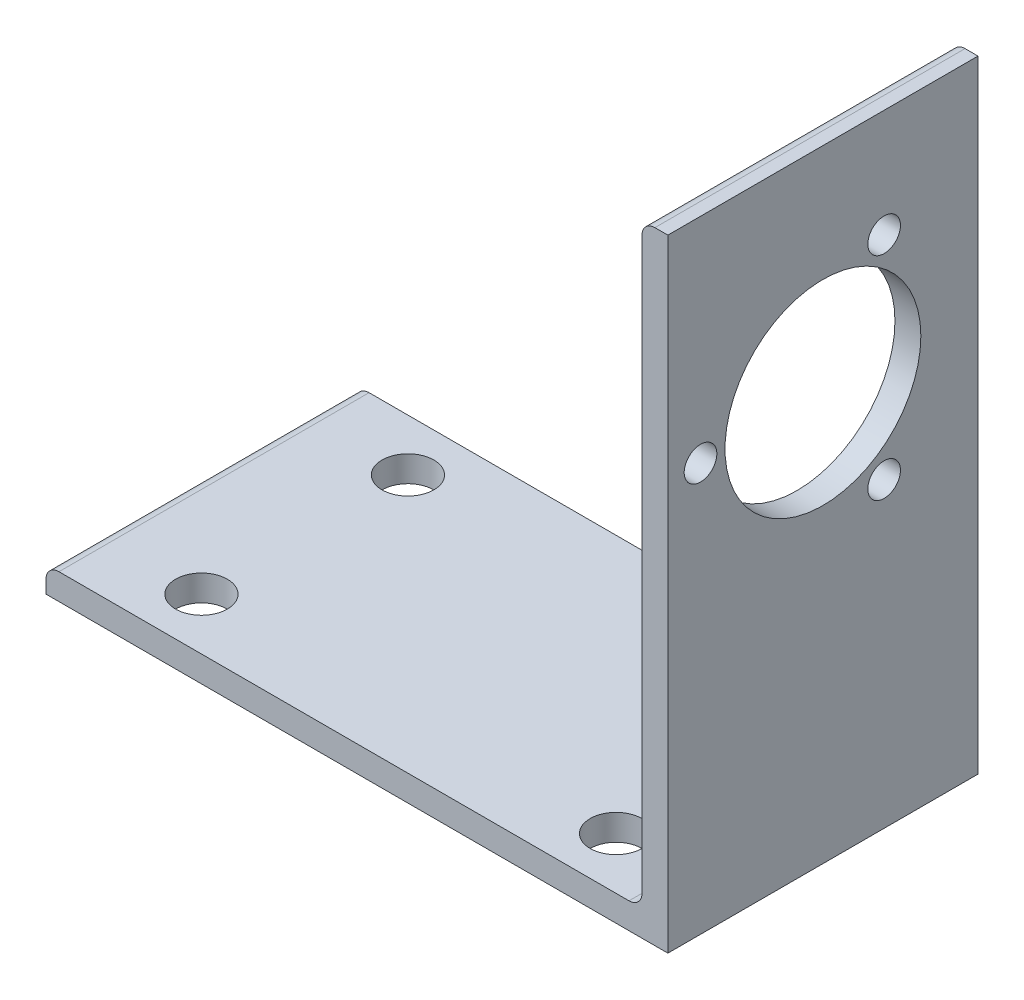
ISO-10303-21;
HEADER;
FILE_DESCRIPTION(('STEP AP214'),'2;1');
FILE_NAME('part.step','',(''),(''),'','','');
FILE_SCHEMA(('AUTOMOTIVE_DESIGN { 1 0 10303 214 1 1 1 1 }'));
ENDSEC;
DATA;
#1=APPLICATION_CONTEXT('core data for automotive mechanical design processes');
#2=APPLICATION_PROTOCOL_DEFINITION('international standard','automotive_design',2000,#1);
#3=PRODUCT_CONTEXT('',#1,'mechanical');
#4=PRODUCT('Part','Part','',(#3));
#5=PRODUCT_RELATED_PRODUCT_CATEGORY('part','',(#4));
#6=PRODUCT_DEFINITION_FORMATION('','',#4);
#7=PRODUCT_DEFINITION_CONTEXT('part definition',#1,'design');
#8=PRODUCT_DEFINITION('design','',#6,#7);
#9=PRODUCT_DEFINITION_SHAPE('','',#8);
#10=(LENGTH_UNIT() NAMED_UNIT(*) SI_UNIT(.MILLI.,.METRE.));
#11=(NAMED_UNIT(*) PLANE_ANGLE_UNIT() SI_UNIT($,.RADIAN.));
#12=(NAMED_UNIT(*) SI_UNIT($,.STERADIAN.) SOLID_ANGLE_UNIT());
#13=UNCERTAINTY_MEASURE_WITH_UNIT(LENGTH_MEASURE(1.E-05),#10,'distance_accuracy_value','');
#14=(GEOMETRIC_REPRESENTATION_CONTEXT(3) GLOBAL_UNCERTAINTY_ASSIGNED_CONTEXT((#13)) GLOBAL_UNIT_ASSIGNED_CONTEXT((#10,
#11,#12)) REPRESENTATION_CONTEXT('',''));
#15=CARTESIAN_POINT('',(0.,0.,0.));
#16=DIRECTION('',(0.,0.,1.));
#17=DIRECTION('',(1.,0.,0.));
#18=AXIS2_PLACEMENT_3D('',#15,#16,#17);
#19=CARTESIAN_POINT('',(17.4625,37.30625,-18.9999999999999));
#20=DIRECTION('',(-1.,0.,0.));
#21=DIRECTION('',(0.,-1.,0.));
#22=AXIS2_PLACEMENT_3D('',#19,#20,#21);
#23=PLANE('',#22);
#24=CARTESIAN_POINT('',(17.4625,18.5048094715972,-13.25));
#25=DIRECTION('',(-1.,0.,0.));
#26=DIRECTION('',(0.,-1.,0.));
#27=AXIS2_PLACEMENT_3D('',#24,#25,#26);
#28=CIRCLE('',#27,1.00000000000001);
#29=CARTESIAN_POINT('',(17.4625,17.5048094715972,-13.25));
#30=VERTEX_POINT('',#29);
#31=EDGE_CURVE('E258',#30,#30,#28,.T.);
#32=ORIENTED_EDGE('',*,*,#31,.F.);
#33=EDGE_LOOP('',(#32));
#34=FACE_BOUND('',#33,.T.);
#35=DIRECTION('',(0.,-1.,0.));
#36=VECTOR('',#35,1.);
#37=CARTESIAN_POINT('',(17.4625,37.30625,0.));
#38=LINE('',#37,#36);
#39=CARTESIAN_POINT('',(17.4625,37.30625,0.));
#40=VERTEX_POINT('',#39);
#41=CARTESIAN_POINT('',(17.4625,2.38124999999999,0.));
#42=VERTEX_POINT('',#41);
#43=EDGE_CURVE('E168',#40,#42,#38,.T.);
#44=ORIENTED_EDGE('',*,*,#43,.F.);
#45=DIRECTION('',(0.,0.,1.));
#46=VECTOR('',#45,1.);
#47=CARTESIAN_POINT('',(17.4625,37.30625,-18.9999999999999));
#48=LINE('',#47,#46);
#49=CARTESIAN_POINT('',(17.4625,37.30625,-18.9999999999999));
#50=VERTEX_POINT('',#49);
#51=EDGE_CURVE('E180',#50,#40,#48,.T.);
#52=ORIENTED_EDGE('',*,*,#51,.F.);
#53=DIRECTION('',(0.,-1.,0.));
#54=VECTOR('',#53,1.);
#55=CARTESIAN_POINT('',(17.4625,37.30625,-18.9999999999999));
#56=LINE('',#55,#54);
#57=CARTESIAN_POINT('',(17.4625,2.38124999999999,-18.9999999999999));
#58=VERTEX_POINT('',#57);
#59=EDGE_CURVE('E145',#50,#58,#56,.T.);
#60=ORIENTED_EDGE('',*,*,#59,.T.);
#61=DIRECTION('',(0.,0.,1.));
#62=VECTOR('',#61,1.);
#63=CARTESIAN_POINT('',(17.4625,2.38124999999999,-18.9999999999999));
#64=LINE('',#63,#62);
#65=EDGE_CURVE('E134',#58,#42,#64,.T.);
#66=ORIENTED_EDGE('',*,*,#65,.T.);
#67=EDGE_LOOP('',(#44,#52,#60,#66));
#68=FACE_BOUND('',#67,.T.);
#69=CARTESIAN_POINT('',(17.4625,24.9999999999972,-9.49999999999995));
#70=DIRECTION('',(-1.,0.,0.));
#71=DIRECTION('',(0.,-1.,0.));
#72=AXIS2_PLACEMENT_3D('',#69,#70,#71);
#73=CIRCLE('',#72,5.99948);
#74=CARTESIAN_POINT('',(17.4625,19.0005199999972,-9.49999999999995));
#75=VERTEX_POINT('',#74);
#76=EDGE_CURVE('E261',#75,#75,#73,.F.);
#77=ORIENTED_EDGE('',*,*,#76,.T.);
#78=EDGE_LOOP('',(#77));
#79=FACE_BOUND('',#78,.T.);
#80=CARTESIAN_POINT('',(17.4625,31.4951905283972,-13.25));
#81=DIRECTION('',(-1.,0.,0.));
#82=DIRECTION('',(0.,-1.,0.));
#83=AXIS2_PLACEMENT_3D('',#80,#81,#82);
#84=CIRCLE('',#83,1.00000000000001);
#85=CARTESIAN_POINT('',(17.4625,30.4951905283972,-13.25));
#86=VERTEX_POINT('',#85);
#87=EDGE_CURVE('E257',#86,#86,#84,.T.);
#88=ORIENTED_EDGE('',*,*,#87,.F.);
#89=EDGE_LOOP('',(#88));
#90=FACE_BOUND('',#89,.T.);
#91=CARTESIAN_POINT('',(17.4625,24.9999999999972,-2.));
#92=DIRECTION('',(-1.,0.,0.));
#93=DIRECTION('',(0.,-1.,0.));
#94=AXIS2_PLACEMENT_3D('',#91,#92,#93);
#95=CIRCLE('',#94,1.);
#96=CARTESIAN_POINT('',(17.4625,23.9999999999972,-2.));
#97=VERTEX_POINT('',#96);
#98=EDGE_CURVE('E246',#97,#97,#95,.T.);
#99=ORIENTED_EDGE('',*,*,#98,.F.);
#100=EDGE_LOOP('',(#99));
#101=FACE_BOUND('',#100,.T.);
#102=ADVANCED_FACE('F48',(#34,#68,#79,#90,#101),#23,.T.);
#103=CARTESIAN_POINT('',(19.05,0.,-18.9999999999999));
#104=DIRECTION('',(1.,0.,0.));
#105=DIRECTION('',(0.,1.,0.));
#106=AXIS2_PLACEMENT_3D('',#103,#104,#105);
#107=PLANE('',#106);
#108=CARTESIAN_POINT('',(19.05,18.5048094715972,-13.25));
#109=DIRECTION('',(1.,0.,0.));
#110=DIRECTION('',(0.,0.,-1.));
#111=AXIS2_PLACEMENT_3D('',#108,#109,#110);
#112=CIRCLE('',#111,1.00000000000001);
#113=CARTESIAN_POINT('',(19.05,18.5048094715972,-14.25));
#114=VERTEX_POINT('',#113);
#115=EDGE_CURVE('E262',#114,#114,#112,.F.);
#116=ORIENTED_EDGE('',*,*,#115,.T.);
#117=EDGE_LOOP('',(#116));
#118=FACE_BOUND('',#117,.T.);
#119=DIRECTION('',(0.,1.,0.));
#120=VECTOR('',#119,1.);
#121=CARTESIAN_POINT('',(19.05,0.,0.));
#122=LINE('',#121,#120);
#123=CARTESIAN_POINT('',(19.05,0.,0.));
#124=VERTEX_POINT('',#123);
#125=CARTESIAN_POINT('',(19.05,38.1,0.));
#126=VERTEX_POINT('',#125);
#127=EDGE_CURVE('E159',#124,#126,#122,.T.);
#128=ORIENTED_EDGE('',*,*,#127,.F.);
#129=DIRECTION('',(0.,0.,1.));
#130=VECTOR('',#129,1.);
#131=CARTESIAN_POINT('',(19.05,0.,-18.9999999999999));
#132=LINE('',#131,#130);
#133=CARTESIAN_POINT('',(19.05,0.,-18.9999999999999));
#134=VERTEX_POINT('',#133);
#135=EDGE_CURVE('E185',#134,#124,#132,.T.);
#136=ORIENTED_EDGE('',*,*,#135,.F.);
#137=DIRECTION('',(0.,1.,0.));
#138=VECTOR('',#137,1.);
#139=CARTESIAN_POINT('',(19.05,0.,-18.9999999999999));
#140=LINE('',#139,#138);
#141=CARTESIAN_POINT('',(19.05,38.1,-18.9999999999999));
#142=VERTEX_POINT('',#141);
#143=EDGE_CURVE('E276',#134,#142,#140,.T.);
#144=ORIENTED_EDGE('',*,*,#143,.T.);
#145=DIRECTION('',(0.,0.,1.));
#146=VECTOR('',#145,1.);
#147=CARTESIAN_POINT('',(19.05,38.1,-18.9999999999999));
#148=LINE('',#147,#146);
#149=EDGE_CURVE('E184',#142,#126,#148,.T.);
#150=ORIENTED_EDGE('',*,*,#149,.T.);
#151=EDGE_LOOP('',(#128,#136,#144,#150));
#152=FACE_BOUND('',#151,.T.);
#153=CARTESIAN_POINT('',(19.05,24.9999999999972,-9.49999999999995));
#154=DIRECTION('',(1.,0.,0.));
#155=DIRECTION('',(0.,0.,-1.));
#156=AXIS2_PLACEMENT_3D('',#153,#154,#155);
#157=CIRCLE('',#156,5.99948);
#158=CARTESIAN_POINT('',(19.05,24.9999999999972,-15.49948));
#159=VERTEX_POINT('',#158);
#160=EDGE_CURVE('E156',#159,#159,#157,.T.);
#161=ORIENTED_EDGE('',*,*,#160,.F.);
#162=EDGE_LOOP('',(#161));
#163=FACE_BOUND('',#162,.T.);
#164=CARTESIAN_POINT('',(19.05,31.4951905283972,-13.25));
#165=DIRECTION('',(1.,0.,0.));
#166=DIRECTION('',(0.,0.,-1.));
#167=AXIS2_PLACEMENT_3D('',#164,#165,#166);
#168=CIRCLE('',#167,1.00000000000001);
#169=CARTESIAN_POINT('',(19.05,31.4951905283972,-14.25));
#170=VERTEX_POINT('',#169);
#171=EDGE_CURVE('E254',#170,#170,#168,.F.);
#172=ORIENTED_EDGE('',*,*,#171,.T.);
#173=EDGE_LOOP('',(#172));
#174=FACE_BOUND('',#173,.T.);
#175=CARTESIAN_POINT('',(19.05,24.9999999999972,-2.));
#176=DIRECTION('',(1.,0.,0.));
#177=DIRECTION('',(0.,0.,-1.));
#178=AXIS2_PLACEMENT_3D('',#175,#176,#177);
#179=CIRCLE('',#178,1.);
#180=CARTESIAN_POINT('',(19.05,24.9999999999972,-3.));
#181=VERTEX_POINT('',#180);
#182=EDGE_CURVE('E242',#181,#181,#179,.F.);
#183=ORIENTED_EDGE('',*,*,#182,.T.);
#184=EDGE_LOOP('',(#183));
#185=FACE_BOUND('',#184,.T.);
#186=ADVANCED_FACE('F199',(#118,#152,#163,#174,#185),#107,.T.);
#187=CARTESIAN_POINT('',(-19.05,0.793749999999996,-18.9999999999999));
#188=DIRECTION('',(-1.,0.,0.));
#189=DIRECTION('',(0.,0.,1.));
#190=AXIS2_PLACEMENT_3D('',#187,#188,#189);
#191=PLANE('',#190);
#192=DIRECTION('',(0.,-1.,0.));
#193=VECTOR('',#192,1.);
#194=CARTESIAN_POINT('',(-19.05,0.793749999999996,0.));
#195=LINE('',#194,#193);
#196=CARTESIAN_POINT('',(-19.05,0.793749999999996,0.));
#197=VERTEX_POINT('',#196);
#198=CARTESIAN_POINT('',(-19.05,0.,0.));
#199=VERTEX_POINT('',#198);
#200=EDGE_CURVE('E152',#197,#199,#195,.T.);
#201=ORIENTED_EDGE('',*,*,#200,.F.);
#202=DIRECTION('',(0.,0.,1.));
#203=VECTOR('',#202,1.);
#204=CARTESIAN_POINT('',(-19.05,0.793749999999996,-18.9999999999999));
#205=LINE('',#204,#203);
#206=CARTESIAN_POINT('',(-19.05,0.793749999999996,-18.9999999999999));
#207=VERTEX_POINT('',#206);
#208=EDGE_CURVE('E12',#207,#197,#205,.T.);
#209=ORIENTED_EDGE('',*,*,#208,.F.);
#210=DIRECTION('',(0.,-1.,0.));
#211=VECTOR('',#210,1.);
#212=CARTESIAN_POINT('',(-19.05,0.793749999999996,-18.9999999999999));
#213=LINE('',#212,#211);
#214=CARTESIAN_POINT('',(-19.05,0.,-18.9999999999999));
#215=VERTEX_POINT('',#214);
#216=EDGE_CURVE('E176',#207,#215,#213,.T.);
#217=ORIENTED_EDGE('',*,*,#216,.T.);
#218=DIRECTION('',(0.,0.,1.));
#219=VECTOR('',#218,1.);
#220=CARTESIAN_POINT('',(-19.05,0.,-18.9999999999999));
#221=LINE('',#220,#219);
#222=EDGE_CURVE('E52',#215,#199,#221,.T.);
#223=ORIENTED_EDGE('',*,*,#222,.T.);
#224=EDGE_LOOP('',(#201,#209,#217,#223));
#225=FACE_BOUND('',#224,.T.);
#226=ADVANCED_FACE('F50',(#225),#191,.T.);
#227=CARTESIAN_POINT('',(-18.25625,0.793749999999996,-18.9999999999999));
#228=DIRECTION('',(0.,0.,1.));
#229=DIRECTION('',(1.,0.,0.));
#230=AXIS2_PLACEMENT_3D('',#227,#228,#229);
#231=CYLINDRICAL_SURFACE('',#230,0.793749999999996);
#232=CARTESIAN_POINT('',(-18.25625,0.793749999999996,0.));
#233=DIRECTION('',(0.,0.,1.));
#234=DIRECTION('',(-1.,0.,0.));
#235=AXIS2_PLACEMENT_3D('',#232,#233,#234);
#236=CIRCLE('',#235,0.793749999999996);
#237=CARTESIAN_POINT('',(-18.25625,1.58749999999999,0.));
#238=VERTEX_POINT('',#237);
#239=EDGE_CURVE('E174',#238,#197,#236,.T.);
#240=ORIENTED_EDGE('',*,*,#239,.F.);
#241=DIRECTION('',(0.,0.,1.));
#242=VECTOR('',#241,1.);
#243=CARTESIAN_POINT('',(-18.25625,1.58749999999999,-18.9999999999999));
#244=LINE('',#243,#242);
#245=CARTESIAN_POINT('',(-18.25625,1.58749999999999,-18.9999999999999));
#246=VERTEX_POINT('',#245);
#247=EDGE_CURVE('E58',#246,#238,#244,.T.);
#248=ORIENTED_EDGE('',*,*,#247,.F.);
#249=CARTESIAN_POINT('',(-18.25625,0.793749999999996,-18.9999999999999));
#250=DIRECTION('',(0.,0.,1.));
#251=DIRECTION('',(-1.,0.,0.));
#252=AXIS2_PLACEMENT_3D('',#249,#250,#251);
#253=CIRCLE('',#252,0.793749999999996);
#254=EDGE_CURVE('E142',#246,#207,#253,.T.);
#255=ORIENTED_EDGE('',*,*,#254,.T.);
#256=ORIENTED_EDGE('',*,*,#208,.T.);
#257=EDGE_LOOP('',(#240,#248,#255,#256));
#258=FACE_BOUND('',#257,.T.);
#259=ADVANCED_FACE('F190',(#258),#231,.T.);
#260=CARTESIAN_POINT('',(16.66875,1.5875,-18.9999999999999));
#261=DIRECTION('',(0.,1.,0.));
#262=DIRECTION('',(-1.,0.,0.));
#263=AXIS2_PLACEMENT_3D('',#260,#261,#262);
#264=PLANE('',#263);
#265=CARTESIAN_POINT('',(-12.7,1.5875,-3.175));
#266=DIRECTION('',(0.,1.,0.));
#267=DIRECTION('',(-1.,0.,0.));
#268=AXIS2_PLACEMENT_3D('',#265,#266,#267);
#269=CIRCLE('',#268,1.5875);
#270=CARTESIAN_POINT('',(-14.2875,1.5875,-3.175));
#271=VERTEX_POINT('',#270);
#272=EDGE_CURVE('E251',#271,#271,#269,.F.);
#273=ORIENTED_EDGE('',*,*,#272,.T.);
#274=EDGE_LOOP('',(#273));
#275=FACE_BOUND('',#274,.T.);
#276=CARTESIAN_POINT('',(12.7,1.5875,-3.175));
#277=DIRECTION('',(0.,1.,0.));
#278=DIRECTION('',(-1.,0.,0.));
#279=AXIS2_PLACEMENT_3D('',#276,#277,#278);
#280=CIRCLE('',#279,1.5875);
#281=CARTESIAN_POINT('',(11.1125,1.5875,-3.175));
#282=VERTEX_POINT('',#281);
#283=EDGE_CURVE('E403',#282,#282,#280,.F.);
#284=ORIENTED_EDGE('',*,*,#283,.T.);
#285=EDGE_LOOP('',(#284));
#286=FACE_BOUND('',#285,.T.);
#287=CARTESIAN_POINT('',(12.7,1.5875,-15.8249999999999));
#288=DIRECTION('',(0.,1.,0.));
#289=DIRECTION('',(-1.,0.,0.));
#290=AXIS2_PLACEMENT_3D('',#287,#288,#289);
#291=CIRCLE('',#290,1.5875);
#292=CARTESIAN_POINT('',(11.1125,1.5875,-15.8249999999999));
#293=VERTEX_POINT('',#292);
#294=EDGE_CURVE('E408',#293,#293,#291,.F.);
#295=ORIENTED_EDGE('',*,*,#294,.T.);
#296=EDGE_LOOP('',(#295));
#297=FACE_BOUND('',#296,.T.);
#298=CARTESIAN_POINT('',(-12.7,1.5875,-15.8249999999999));
#299=DIRECTION('',(0.,1.,0.));
#300=DIRECTION('',(-1.,0.,0.));
#301=AXIS2_PLACEMENT_3D('',#298,#299,#300);
#302=CIRCLE('',#301,1.5875);
#303=CARTESIAN_POINT('',(-14.2875,1.5875,-15.8249999999999));
#304=VERTEX_POINT('',#303);
#305=EDGE_CURVE('E243',#304,#304,#302,.F.);
#306=ORIENTED_EDGE('',*,*,#305,.T.);
#307=EDGE_LOOP('',(#306));
#308=FACE_BOUND('',#307,.T.);
#309=DIRECTION('',(-1.,0.,0.));
#310=VECTOR('',#309,1.);
#311=CARTESIAN_POINT('',(16.66875,1.5875,0.));
#312=LINE('',#311,#310);
#313=CARTESIAN_POINT('',(16.66875,1.5875,0.));
#314=VERTEX_POINT('',#313);
#315=EDGE_CURVE('E129',#314,#238,#312,.T.);
#316=ORIENTED_EDGE('',*,*,#315,.F.);
#317=DIRECTION('',(0.,0.,1.));
#318=VECTOR('',#317,1.);
#319=CARTESIAN_POINT('',(16.66875,1.5875,-18.9999999999999));
#320=LINE('',#319,#318);
#321=CARTESIAN_POINT('',(16.66875,1.5875,-18.9999999999999));
#322=VERTEX_POINT('',#321);
#323=EDGE_CURVE('E124',#322,#314,#320,.T.);
#324=ORIENTED_EDGE('',*,*,#323,.F.);
#325=DIRECTION('',(-1.,0.,0.));
#326=VECTOR('',#325,1.);
#327=CARTESIAN_POINT('',(16.66875,1.5875,-18.9999999999999));
#328=LINE('',#327,#326);
#329=EDGE_CURVE('E127',#322,#246,#328,.T.);
#330=ORIENTED_EDGE('',*,*,#329,.T.);
#331=ORIENTED_EDGE('',*,*,#247,.T.);
#332=EDGE_LOOP('',(#316,#324,#330,#331));
#333=FACE_BOUND('',#332,.T.);
#334=ADVANCED_FACE('F126',(#275,#286,#297,#308,#333),#264,.T.);
#335=CARTESIAN_POINT('',(16.66875,2.38124999999999,-18.9999999999999));
#336=DIRECTION('',(0.,0.,1.));
#337=DIRECTION('',(1.,0.,0.));
#338=AXIS2_PLACEMENT_3D('',#335,#336,#337);
#339=CYLINDRICAL_SURFACE('',#338,0.793749999999995);
#340=CARTESIAN_POINT('',(16.66875,2.38124999999999,0.));
#341=DIRECTION('',(0.,0.,-1.));
#342=DIRECTION('',(-1.,0.,0.));
#343=AXIS2_PLACEMENT_3D('',#340,#341,#342);
#344=CIRCLE('',#343,0.793749999999995);
#345=EDGE_CURVE('E171',#42,#314,#344,.T.);
#346=ORIENTED_EDGE('',*,*,#345,.F.);
#347=ORIENTED_EDGE('',*,*,#65,.F.);
#348=CARTESIAN_POINT('',(16.66875,2.38124999999999,-18.9999999999999));
#349=DIRECTION('',(0.,0.,-1.));
#350=DIRECTION('',(-1.,0.,0.));
#351=AXIS2_PLACEMENT_3D('',#348,#349,#350);
#352=CIRCLE('',#351,0.793749999999995);
#353=EDGE_CURVE('E140',#58,#322,#352,.T.);
#354=ORIENTED_EDGE('',*,*,#353,.T.);
#355=ORIENTED_EDGE('',*,*,#323,.T.);
#356=EDGE_LOOP('',(#346,#347,#354,#355));
#357=FACE_BOUND('',#356,.T.);
#358=ADVANCED_FACE('F144',(#357),#339,.F.);
#359=CARTESIAN_POINT('',(18.25625,37.30625,-18.9999999999999));
#360=DIRECTION('',(0.,0.,1.));
#361=DIRECTION('',(1.,0.,0.));
#362=AXIS2_PLACEMENT_3D('',#359,#360,#361);
#363=CYLINDRICAL_SURFACE('',#362,0.793749999999996);
#364=CARTESIAN_POINT('',(18.25625,37.30625,0.));
#365=DIRECTION('',(0.,0.,1.));
#366=DIRECTION('',(-1.,0.,0.));
#367=AXIS2_PLACEMENT_3D('',#364,#365,#366);
#368=CIRCLE('',#367,0.793749999999996);
#369=CARTESIAN_POINT('',(18.25625,38.1,0.));
#370=VERTEX_POINT('',#369);
#371=EDGE_CURVE('E165',#370,#40,#368,.T.);
#372=ORIENTED_EDGE('',*,*,#371,.F.);
#373=DIRECTION('',(0.,0.,1.));
#374=VECTOR('',#373,1.);
#375=CARTESIAN_POINT('',(18.25625,38.1,-18.9999999999999));
#376=LINE('',#375,#374);
#377=CARTESIAN_POINT('',(18.25625,38.1,-18.9999999999999));
#378=VERTEX_POINT('',#377);
#379=EDGE_CURVE('E182',#378,#370,#376,.T.);
#380=ORIENTED_EDGE('',*,*,#379,.F.);
#381=CARTESIAN_POINT('',(18.25625,37.30625,-18.9999999999999));
#382=DIRECTION('',(0.,0.,1.));
#383=DIRECTION('',(-1.,0.,0.));
#384=AXIS2_PLACEMENT_3D('',#381,#382,#383);
#385=CIRCLE('',#384,0.793749999999996);
#386=EDGE_CURVE('E147',#378,#50,#385,.T.);
#387=ORIENTED_EDGE('',*,*,#386,.T.);
#388=ORIENTED_EDGE('',*,*,#51,.T.);
#389=EDGE_LOOP('',(#372,#380,#387,#388));
#390=FACE_BOUND('',#389,.T.);
#391=ADVANCED_FACE('F213',(#390),#363,.T.);
#392=CARTESIAN_POINT('',(18.25625,38.1,-18.9999999999999));
#393=DIRECTION('',(0.,1.,0.));
#394=DIRECTION('',(0.,0.,1.));
#395=AXIS2_PLACEMENT_3D('',#392,#393,#394);
#396=PLANE('',#395);
#397=DIRECTION('',(-1.,0.,0.));
#398=VECTOR('',#397,1.);
#399=CARTESIAN_POINT('',(18.25625,38.1,0.));
#400=LINE('',#399,#398);
#401=EDGE_CURVE('E162',#126,#370,#400,.T.);
#402=ORIENTED_EDGE('',*,*,#401,.F.);
#403=ORIENTED_EDGE('',*,*,#149,.F.);
#404=DIRECTION('',(-1.,0.,0.));
#405=VECTOR('',#404,1.);
#406=CARTESIAN_POINT('',(18.25625,38.1,-18.9999999999999));
#407=LINE('',#406,#405);
#408=EDGE_CURVE('E279',#142,#378,#407,.T.);
#409=ORIENTED_EDGE('',*,*,#408,.T.);
#410=ORIENTED_EDGE('',*,*,#379,.T.);
#411=EDGE_LOOP('',(#402,#403,#409,#410));
#412=FACE_BOUND('',#411,.T.);
#413=ADVANCED_FACE('F216',(#412),#396,.T.);
#414=CARTESIAN_POINT('',(-19.05,0.,-18.9999999999999));
#415=DIRECTION('',(0.,-1.,0.));
#416=DIRECTION('',(0.,0.,-1.));
#417=AXIS2_PLACEMENT_3D('',#414,#415,#416);
#418=PLANE('',#417);
#419=CARTESIAN_POINT('',(-12.7,0.,-3.175));
#420=DIRECTION('',(0.,-1.,0.));
#421=DIRECTION('',(0.,0.,-1.));
#422=AXIS2_PLACEMENT_3D('',#419,#420,#421);
#423=CIRCLE('',#422,1.5875);
#424=CARTESIAN_POINT('',(-12.7,0.,-4.7625));
#425=VERTEX_POINT('',#424);
#426=EDGE_CURVE('E229',#425,#425,#423,.T.);
#427=ORIENTED_EDGE('',*,*,#426,.F.);
#428=EDGE_LOOP('',(#427));
#429=FACE_BOUND('',#428,.T.);
#430=CARTESIAN_POINT('',(12.7,0.,-3.175));
#431=DIRECTION('',(0.,-1.,0.));
#432=DIRECTION('',(0.,0.,-1.));
#433=AXIS2_PLACEMENT_3D('',#430,#431,#432);
#434=CIRCLE('',#433,1.5875);
#435=CARTESIAN_POINT('',(12.7,0.,-4.76250000000001));
#436=VERTEX_POINT('',#435);
#437=EDGE_CURVE('E233',#436,#436,#434,.T.);
#438=ORIENTED_EDGE('',*,*,#437,.F.);
#439=EDGE_LOOP('',(#438));
#440=FACE_BOUND('',#439,.T.);
#441=CARTESIAN_POINT('',(12.7,0.,-15.8249999999999));
#442=DIRECTION('',(0.,-1.,0.));
#443=DIRECTION('',(0.,0.,-1.));
#444=AXIS2_PLACEMENT_3D('',#441,#442,#443);
#445=CIRCLE('',#444,1.5875);
#446=CARTESIAN_POINT('',(12.7,0.,-17.4124999999999));
#447=VERTEX_POINT('',#446);
#448=EDGE_CURVE('E237',#447,#447,#445,.T.);
#449=ORIENTED_EDGE('',*,*,#448,.F.);
#450=EDGE_LOOP('',(#449));
#451=FACE_BOUND('',#450,.T.);
#452=CARTESIAN_POINT('',(-12.7,0.,-15.8249999999999));
#453=DIRECTION('',(0.,-1.,0.));
#454=DIRECTION('',(0.,0.,-1.));
#455=AXIS2_PLACEMENT_3D('',#452,#453,#454);
#456=CIRCLE('',#455,1.5875);
#457=CARTESIAN_POINT('',(-12.7,0.,-17.4124999999999));
#458=VERTEX_POINT('',#457);
#459=EDGE_CURVE('E240',#458,#458,#456,.T.);
#460=ORIENTED_EDGE('',*,*,#459,.F.);
#461=EDGE_LOOP('',(#460));
#462=FACE_BOUND('',#461,.T.);
#463=DIRECTION('',(1.,0.,0.));
#464=VECTOR('',#463,1.);
#465=CARTESIAN_POINT('',(-19.05,0.,0.));
#466=LINE('',#465,#464);
#467=EDGE_CURVE('E155',#199,#124,#466,.T.);
#468=ORIENTED_EDGE('',*,*,#467,.F.);
#469=ORIENTED_EDGE('',*,*,#222,.F.);
#470=DIRECTION('',(1.,0.,0.));
#471=VECTOR('',#470,1.);
#472=CARTESIAN_POINT('',(-19.05,0.,-18.9999999999999));
#473=LINE('',#472,#471);
#474=EDGE_CURVE('E274',#215,#134,#473,.T.);
#475=ORIENTED_EDGE('',*,*,#474,.T.);
#476=ORIENTED_EDGE('',*,*,#135,.T.);
#477=EDGE_LOOP('',(#468,#469,#475,#476));
#478=FACE_BOUND('',#477,.T.);
#479=ADVANCED_FACE('F187',(#429,#440,#451,#462,#478),#418,.T.);
#480=CARTESIAN_POINT('',(18.25625,37.30625,-18.9999999999999));
#481=DIRECTION('',(0.,0.,-1.));
#482=DIRECTION('',(-1.,0.,0.));
#483=AXIS2_PLACEMENT_3D('',#480,#481,#482);
#484=PLANE('',#483);
#485=ORIENTED_EDGE('',*,*,#216,.F.);
#486=ORIENTED_EDGE('',*,*,#254,.F.);
#487=ORIENTED_EDGE('',*,*,#329,.F.);
#488=ORIENTED_EDGE('',*,*,#353,.F.);
#489=ORIENTED_EDGE('',*,*,#59,.F.);
#490=ORIENTED_EDGE('',*,*,#386,.F.);
#491=ORIENTED_EDGE('',*,*,#408,.F.);
#492=ORIENTED_EDGE('',*,*,#143,.F.);
#493=ORIENTED_EDGE('',*,*,#474,.F.);
#494=EDGE_LOOP('',(#485,#486,#487,#488,#489,#490,#491,#492,#493));
#495=FACE_BOUND('',#494,.T.);
#496=ADVANCED_FACE('F138',(#495),#484,.T.);
#497=CARTESIAN_POINT('',(18.25625,37.30625,0.));
#498=DIRECTION('',(0.,0.,-1.));
#499=DIRECTION('',(-1.,0.,0.));
#500=AXIS2_PLACEMENT_3D('',#497,#498,#499);
#501=PLANE('',#500);
#502=ORIENTED_EDGE('',*,*,#200,.T.);
#503=ORIENTED_EDGE('',*,*,#467,.T.);
#504=ORIENTED_EDGE('',*,*,#127,.T.);
#505=ORIENTED_EDGE('',*,*,#401,.T.);
#506=ORIENTED_EDGE('',*,*,#371,.T.);
#507=ORIENTED_EDGE('',*,*,#43,.T.);
#508=ORIENTED_EDGE('',*,*,#345,.T.);
#509=ORIENTED_EDGE('',*,*,#315,.T.);
#510=ORIENTED_EDGE('',*,*,#239,.T.);
#511=EDGE_LOOP('',(#502,#503,#504,#505,#506,#507,#508,#509,#510));
#512=FACE_BOUND('',#511,.T.);
#513=ADVANCED_FACE('F189',(#512),#501,.F.);
#514=CARTESIAN_POINT('',(-19.051,24.9999999999972,-9.49999999999995));
#515=DIRECTION('',(1.,0.,0.));
#516=DIRECTION('',(0.,0.,-1.));
#517=AXIS2_PLACEMENT_3D('',#514,#515,#516);
#518=CYLINDRICAL_SURFACE('',#517,5.99948);
#519=ORIENTED_EDGE('',*,*,#76,.F.);
#520=EDGE_LOOP('',(#519));
#521=FACE_BOUND('',#520,.T.);
#522=ORIENTED_EDGE('',*,*,#160,.T.);
#523=EDGE_LOOP('',(#522));
#524=FACE_BOUND('',#523,.T.);
#525=ADVANCED_FACE('F317',(#521,#524),#518,.F.);
#526=CARTESIAN_POINT('',(-19.051,31.4951905283972,-13.25));
#527=DIRECTION('',(1.,0.,0.));
#528=DIRECTION('',(0.,0.,-1.));
#529=AXIS2_PLACEMENT_3D('',#526,#527,#528);
#530=CYLINDRICAL_SURFACE('',#529,1.00000000000001);
#531=ORIENTED_EDGE('',*,*,#87,.T.);
#532=EDGE_LOOP('',(#531));
#533=FACE_BOUND('',#532,.T.);
#534=ORIENTED_EDGE('',*,*,#171,.F.);
#535=EDGE_LOOP('',(#534));
#536=FACE_BOUND('',#535,.T.);
#537=ADVANCED_FACE('F312',(#533,#536),#530,.F.);
#538=CARTESIAN_POINT('',(-19.051,18.5048094715972,-13.25));
#539=DIRECTION('',(1.,0.,0.));
#540=DIRECTION('',(0.,0.,-1.));
#541=AXIS2_PLACEMENT_3D('',#538,#539,#540);
#542=CYLINDRICAL_SURFACE('',#541,1.00000000000001);
#543=ORIENTED_EDGE('',*,*,#31,.T.);
#544=EDGE_LOOP('',(#543));
#545=FACE_BOUND('',#544,.T.);
#546=ORIENTED_EDGE('',*,*,#115,.F.);
#547=EDGE_LOOP('',(#546));
#548=FACE_BOUND('',#547,.T.);
#549=ADVANCED_FACE('F301',(#545,#548),#542,.F.);
#550=CARTESIAN_POINT('',(-19.051,24.9999999999972,-2.));
#551=DIRECTION('',(1.,0.,0.));
#552=DIRECTION('',(0.,0.,-1.));
#553=AXIS2_PLACEMENT_3D('',#550,#551,#552);
#554=CYLINDRICAL_SURFACE('',#553,1.);
#555=ORIENTED_EDGE('',*,*,#98,.T.);
#556=EDGE_LOOP('',(#555));
#557=FACE_BOUND('',#556,.T.);
#558=ORIENTED_EDGE('',*,*,#182,.F.);
#559=EDGE_LOOP('',(#558));
#560=FACE_BOUND('',#559,.T.);
#561=ADVANCED_FACE('F297',(#557,#560),#554,.F.);
#562=CARTESIAN_POINT('',(-12.7,38.101,-15.8249999999999));
#563=DIRECTION('',(0.,-1.,0.));
#564=DIRECTION('',(0.,0.,-1.));
#565=AXIS2_PLACEMENT_3D('',#562,#563,#564);
#566=CYLINDRICAL_SURFACE('',#565,1.5875);
#567=ORIENTED_EDGE('',*,*,#305,.F.);
#568=EDGE_LOOP('',(#567));
#569=FACE_BOUND('',#568,.T.);
#570=ORIENTED_EDGE('',*,*,#459,.T.);
#571=EDGE_LOOP('',(#570));
#572=FACE_BOUND('',#571,.T.);
#573=ADVANCED_FACE('F300',(#569,#572),#566,.F.);
#574=CARTESIAN_POINT('',(12.7,38.101,-15.8249999999999));
#575=DIRECTION('',(0.,-1.,0.));
#576=DIRECTION('',(0.,0.,-1.));
#577=AXIS2_PLACEMENT_3D('',#574,#575,#576);
#578=CYLINDRICAL_SURFACE('',#577,1.5875);
#579=ORIENTED_EDGE('',*,*,#294,.F.);
#580=EDGE_LOOP('',(#579));
#581=FACE_BOUND('',#580,.T.);
#582=ORIENTED_EDGE('',*,*,#448,.T.);
#583=EDGE_LOOP('',(#582));
#584=FACE_BOUND('',#583,.T.);
#585=ADVANCED_FACE('F309',(#581,#584),#578,.F.);
#586=CARTESIAN_POINT('',(12.7,38.101,-3.175));
#587=DIRECTION('',(0.,-1.,0.));
#588=DIRECTION('',(0.,0.,-1.));
#589=AXIS2_PLACEMENT_3D('',#586,#587,#588);
#590=CYLINDRICAL_SURFACE('',#589,1.5875);
#591=ORIENTED_EDGE('',*,*,#283,.F.);
#592=EDGE_LOOP('',(#591));
#593=FACE_BOUND('',#592,.T.);
#594=ORIENTED_EDGE('',*,*,#437,.T.);
#595=EDGE_LOOP('',(#594));
#596=FACE_BOUND('',#595,.T.);
#597=ADVANCED_FACE('F376',(#593,#596),#590,.F.);
#598=CARTESIAN_POINT('',(-12.7,38.101,-3.175));
#599=DIRECTION('',(0.,-1.,0.));
#600=DIRECTION('',(0.,0.,-1.));
#601=AXIS2_PLACEMENT_3D('',#598,#599,#600);
#602=CYLINDRICAL_SURFACE('',#601,1.5875);
#603=ORIENTED_EDGE('',*,*,#272,.F.);
#604=EDGE_LOOP('',(#603));
#605=FACE_BOUND('',#604,.T.);
#606=ORIENTED_EDGE('',*,*,#426,.T.);
#607=EDGE_LOOP('',(#606));
#608=FACE_BOUND('',#607,.T.);
#609=ADVANCED_FACE('F386',(#605,#608),#602,.F.);
#610=CLOSED_SHELL('',(#102,#186,#226,#259,#334,#358,#391,#413,#479,#496,#513,#525,#537,#549,
#561,#573,#585,#597,#609));
#611=MANIFOLD_SOLID_BREP('B2',#610);
#612=ADVANCED_BREP_SHAPE_REPRESENTATION('',(#18,#611),#14);
#613=SHAPE_DEFINITION_REPRESENTATION(#9,#612);
ENDSEC;
END-ISO-10303-21;
